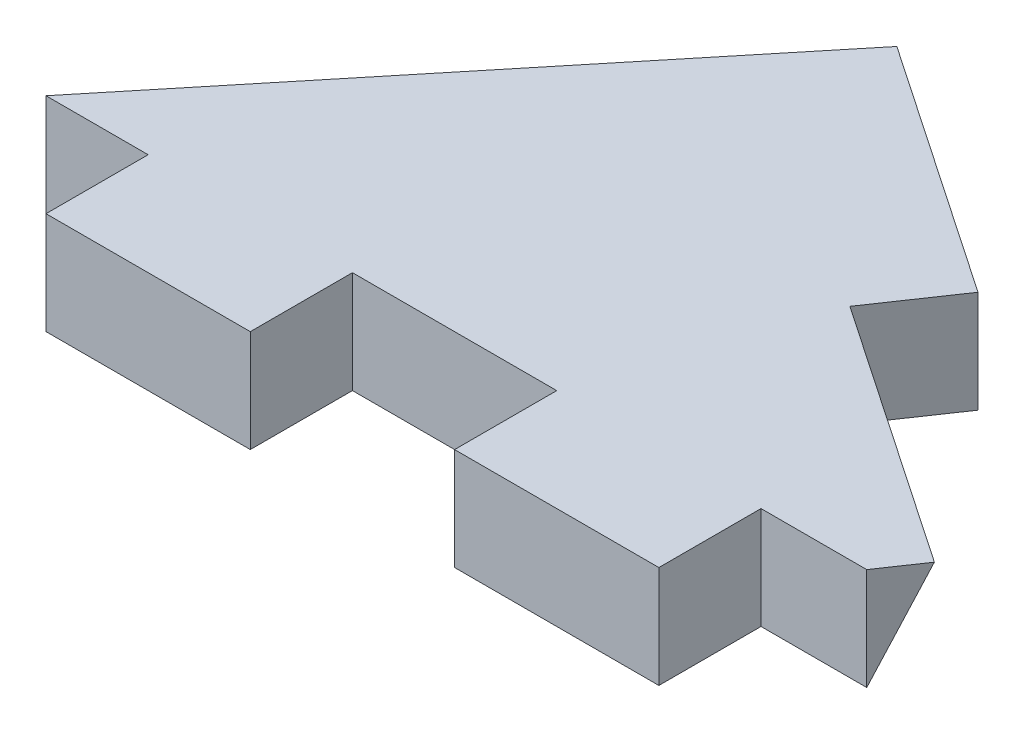
ISO-10303-21;
HEADER;
FILE_DESCRIPTION(('STEP AP214'),'2;1');
FILE_NAME('part.step','',(''),(''),'','','');
FILE_SCHEMA(('AUTOMOTIVE_DESIGN { 1 0 10303 214 1 1 1 1 }'));
ENDSEC;
DATA;
#1=APPLICATION_CONTEXT('core data for automotive mechanical design processes');
#2=APPLICATION_PROTOCOL_DEFINITION('international standard','automotive_design',2000,#1);
#3=PRODUCT_CONTEXT('',#1,'mechanical');
#4=PRODUCT('Part','Part','',(#3));
#5=PRODUCT_RELATED_PRODUCT_CATEGORY('part','',(#4));
#6=PRODUCT_DEFINITION_FORMATION('','',#4);
#7=PRODUCT_DEFINITION_CONTEXT('part definition',#1,'design');
#8=PRODUCT_DEFINITION('design','',#6,#7);
#9=PRODUCT_DEFINITION_SHAPE('','',#8);
#10=(LENGTH_UNIT() NAMED_UNIT(*) SI_UNIT(.MILLI.,.METRE.));
#11=(NAMED_UNIT(*) PLANE_ANGLE_UNIT() SI_UNIT($,.RADIAN.));
#12=(NAMED_UNIT(*) SI_UNIT($,.STERADIAN.) SOLID_ANGLE_UNIT());
#13=UNCERTAINTY_MEASURE_WITH_UNIT(LENGTH_MEASURE(1.E-05),#10,'distance_accuracy_value','');
#14=(GEOMETRIC_REPRESENTATION_CONTEXT(3) GLOBAL_UNCERTAINTY_ASSIGNED_CONTEXT((#13)) GLOBAL_UNIT_ASSIGNED_CONTEXT((#10,
#11,#12)) REPRESENTATION_CONTEXT('',''));
#15=CARTESIAN_POINT('',(0.,0.,0.));
#16=DIRECTION('',(0.,0.,1.));
#17=DIRECTION('',(1.,0.,0.));
#18=AXIS2_PLACEMENT_3D('',#15,#16,#17);
#19=CARTESIAN_POINT('',(54.526318581706,10.,-27.5542041801845));
#20=DIRECTION('',(-0.827016791360424,0.,-0.562177220107601));
#21=DIRECTION('',(-0.562177220107601,0.,0.827016791360424));
#22=AXIS2_PLACEMENT_3D('',#19,#20,#21);
#23=PLANE('',#22);
#24=DIRECTION('',(-0.241861628242692,-0.902722593813661,0.35580173046534));
#25=VECTOR('',#24,1.);
#26=CARTESIAN_POINT('',(58.3697875832957,14.345335932616,-33.2083169540525));
#27=LINE('',#26,#25);
#28=CARTESIAN_POINT('',(57.2055650069182,10.,-31.4956335063653));
#29=VERTEX_POINT('',#28);
#30=CARTESIAN_POINT('',(54.526318581706,-2.73733741694818E-11,-27.5542041801845));
#31=VERTEX_POINT('',#30);
#32=EDGE_CURVE('E270',#29,#31,#27,.T.);
#33=ORIENTED_EDGE('',*,*,#32,.T.);
#34=DIRECTION('',(0.562177220107601,0.,-0.827016791360423));
#35=VECTOR('',#34,1.);
#36=CARTESIAN_POINT('',(54.526318581706,0.,-27.5542041801845));
#37=LINE('',#36,#35);
#38=CARTESIAN_POINT('',(62.2804657900958,0.,-38.961300936598));
#39=VERTEX_POINT('',#38);
#40=EDGE_CURVE('E171',#31,#39,#37,.T.);
#41=ORIENTED_EDGE('',*,*,#40,.T.);
#42=DIRECTION('',(0.,-1.,0.));
#43=VECTOR('',#42,1.);
#44=CARTESIAN_POINT('',(62.2804657900958,10.,-38.961300936598));
#45=LINE('',#44,#43);
#46=CARTESIAN_POINT('',(62.2804657900958,10.,-38.961300936598));
#47=VERTEX_POINT('',#46);
#48=EDGE_CURVE('E41',#47,#39,#45,.T.);
#49=ORIENTED_EDGE('',*,*,#48,.F.);
#50=DIRECTION('',(0.562177220107601,0.,-0.827016791360423));
#51=VECTOR('',#50,1.);
#52=CARTESIAN_POINT('',(54.526318581706,10.,-27.5542041801845));
#53=LINE('',#52,#51);
#54=EDGE_CURVE('E48',#29,#47,#53,.T.);
#55=ORIENTED_EDGE('',*,*,#54,.F.);
#56=EDGE_LOOP('',(#33,#41,#49,#55));
#57=FACE_BOUND('',#56,.T.);
#58=ADVANCED_FACE('F33',(#57),#23,.F.);
#59=CARTESIAN_POINT('',(70.0000000000252,10.,-10.));
#60=DIRECTION('',(0.,0.,-1.));
#61=DIRECTION('',(-1.,0.,0.));
#62=AXIS2_PLACEMENT_3D('',#59,#60,#61);
#63=PLANE('',#62);
#64=DIRECTION('',(1.,0.,0.));
#65=VECTOR('',#64,1.);
#66=CARTESIAN_POINT('',(70.0000000000252,0.,-10.));
#67=LINE('',#66,#65);
#68=CARTESIAN_POINT('',(70.0000000000252,0.,-10.));
#69=VERTEX_POINT('',#68);
#70=CARTESIAN_POINT('',(80.3502422426526,0.,-10.));
#71=VERTEX_POINT('',#70);
#72=EDGE_CURVE('E164',#69,#71,#67,.T.);
#73=ORIENTED_EDGE('',*,*,#72,.T.);
#74=DIRECTION('',(0.,-1.,0.));
#75=VECTOR('',#74,1.);
#76=CARTESIAN_POINT('',(80.3502422426526,10.,-10.));
#77=LINE('',#76,#75);
#78=CARTESIAN_POINT('',(80.3502422426526,10.,-10.));
#79=VERTEX_POINT('',#78);
#80=EDGE_CURVE('E11',#79,#71,#77,.T.);
#81=ORIENTED_EDGE('',*,*,#80,.F.);
#82=DIRECTION('',(1.,0.,0.));
#83=VECTOR('',#82,1.);
#84=CARTESIAN_POINT('',(70.0000000000252,10.,-10.));
#85=LINE('',#84,#83);
#86=CARTESIAN_POINT('',(70.0000000000252,10.,-10.));
#87=VERTEX_POINT('',#86);
#88=EDGE_CURVE('E108',#87,#79,#85,.T.);
#89=ORIENTED_EDGE('',*,*,#88,.F.);
#90=DIRECTION('',(0.,-1.,0.));
#91=VECTOR('',#90,1.);
#92=CARTESIAN_POINT('',(70.0000000000252,10.,-10.));
#93=LINE('',#92,#91);
#94=EDGE_CURVE('E160',#87,#69,#93,.T.);
#95=ORIENTED_EDGE('',*,*,#94,.T.);
#96=EDGE_LOOP('',(#73,#81,#89,#95));
#97=FACE_BOUND('',#96,.T.);
#98=ADVANCED_FACE('F35',(#97),#63,.F.);
#99=CARTESIAN_POINT('',(62.2804657900958,10.,-38.961300936598));
#100=DIRECTION('',(-0.5621772201076,0.,0.827016791360424));
#101=DIRECTION('',(0.827016791360424,0.,0.5621772201076));
#102=AXIS2_PLACEMENT_3D('',#99,#100,#101);
#103=PLANE('',#102);
#104=DIRECTION('',(-0.827016791360424,0.,-0.5621772201076));
#105=VECTOR('',#104,1.);
#106=CARTESIAN_POINT('',(62.2804657900958,0.,-38.961300936598));
#107=LINE('',#106,#105);
#108=CARTESIAN_POINT('',(37.4699620492831,0.,-55.826617539826));
#109=VERTEX_POINT('',#108);
#110=EDGE_CURVE('E173',#39,#109,#107,.T.);
#111=ORIENTED_EDGE('',*,*,#110,.T.);
#112=DIRECTION('',(0.,-1.,0.));
#113=VECTOR('',#112,1.);
#114=CARTESIAN_POINT('',(37.4699620492831,10.,-55.826617539826));
#115=LINE('',#114,#113);
#116=CARTESIAN_POINT('',(37.4699620492831,10.,-55.826617539826));
#117=VERTEX_POINT('',#116);
#118=EDGE_CURVE('E209',#117,#109,#115,.T.);
#119=ORIENTED_EDGE('',*,*,#118,.F.);
#120=DIRECTION('',(-0.827016791360424,0.,-0.5621772201076));
#121=VECTOR('',#120,1.);
#122=CARTESIAN_POINT('',(62.2804657900958,10.,-38.961300936598));
#123=LINE('',#122,#121);
#124=EDGE_CURVE('E217',#47,#117,#123,.T.);
#125=ORIENTED_EDGE('',*,*,#124,.F.);
#126=ORIENTED_EDGE('',*,*,#48,.T.);
#127=EDGE_LOOP('',(#111,#119,#125,#126));
#128=FACE_BOUND('',#127,.T.);
#129=ADVANCED_FACE('F215',(#128),#103,.F.);
#130=CARTESIAN_POINT('',(0.,10.,-10.));
#131=DIRECTION('',(0.774160461544172,0.,0.632989399422861));
#132=DIRECTION('',(0.632989399422861,0.,-0.774160461544172));
#133=AXIS2_PLACEMENT_3D('',#130,#131,#132);
#134=PLANE('',#133);
#135=DIRECTION('',(-0.632989399422861,0.,0.774160461544172));
#136=VECTOR('',#135,1.);
#137=CARTESIAN_POINT('',(0.,0.,-10.));
#138=LINE('',#137,#136);
#139=CARTESIAN_POINT('',(0.,0.,-10.));
#140=VERTEX_POINT('',#139);
#141=EDGE_CURVE('E175',#109,#140,#138,.T.);
#142=ORIENTED_EDGE('',*,*,#141,.T.);
#143=DIRECTION('',(0.,-1.,0.));
#144=VECTOR('',#143,1.);
#145=CARTESIAN_POINT('',(0.,10.,-10.));
#146=LINE('',#145,#144);
#147=CARTESIAN_POINT('',(0.,10.,-10.));
#148=VERTEX_POINT('',#147);
#149=EDGE_CURVE('E206',#148,#140,#146,.T.);
#150=ORIENTED_EDGE('',*,*,#149,.F.);
#151=DIRECTION('',(-0.632989399422861,0.,0.774160461544172));
#152=VECTOR('',#151,1.);
#153=CARTESIAN_POINT('',(0.,10.,-10.));
#154=LINE('',#153,#152);
#155=EDGE_CURVE('E236',#117,#148,#154,.T.);
#156=ORIENTED_EDGE('',*,*,#155,.F.);
#157=ORIENTED_EDGE('',*,*,#118,.T.);
#158=EDGE_LOOP('',(#142,#150,#156,#157));
#159=FACE_BOUND('',#158,.T.);
#160=ADVANCED_FACE('F227',(#159),#134,.F.);
#161=CARTESIAN_POINT('',(10.0000000000253,10.,-10.));
#162=DIRECTION('',(0.,0.,-1.));
#163=DIRECTION('',(-1.,0.,0.));
#164=AXIS2_PLACEMENT_3D('',#161,#162,#163);
#165=PLANE('',#164);
#166=DIRECTION('',(1.,0.,0.));
#167=VECTOR('',#166,1.);
#168=CARTESIAN_POINT('',(10.0000000000253,0.,-10.));
#169=LINE('',#168,#167);
#170=CARTESIAN_POINT('',(10.0000000000253,0.,-10.));
#171=VERTEX_POINT('',#170);
#172=EDGE_CURVE('E177',#140,#171,#169,.T.);
#173=ORIENTED_EDGE('',*,*,#172,.T.);
#174=DIRECTION('',(0.,-1.,0.));
#175=VECTOR('',#174,1.);
#176=CARTESIAN_POINT('',(10.0000000000253,10.,-10.));
#177=LINE('',#176,#175);
#178=CARTESIAN_POINT('',(10.0000000000253,10.,-10.));
#179=VERTEX_POINT('',#178);
#180=EDGE_CURVE('E203',#179,#171,#177,.T.);
#181=ORIENTED_EDGE('',*,*,#180,.F.);
#182=DIRECTION('',(1.,0.,0.));
#183=VECTOR('',#182,1.);
#184=CARTESIAN_POINT('',(10.0000000000253,10.,-10.));
#185=LINE('',#184,#183);
#186=EDGE_CURVE('E233',#148,#179,#185,.T.);
#187=ORIENTED_EDGE('',*,*,#186,.F.);
#188=ORIENTED_EDGE('',*,*,#149,.T.);
#189=EDGE_LOOP('',(#173,#181,#187,#188));
#190=FACE_BOUND('',#189,.T.);
#191=ADVANCED_FACE('F231',(#190),#165,.F.);
#192=CARTESIAN_POINT('',(10.0000000000252,10.,0.));
#193=DIRECTION('',(1.,0.,0.));
#194=DIRECTION('',(0.,0.,-1.));
#195=AXIS2_PLACEMENT_3D('',#192,#193,#194);
#196=PLANE('',#195);
#197=DIRECTION('',(0.,0.,1.));
#198=VECTOR('',#197,1.);
#199=CARTESIAN_POINT('',(10.0000000000252,0.,0.));
#200=LINE('',#199,#198);
#201=CARTESIAN_POINT('',(10.0000000000252,0.,0.));
#202=VERTEX_POINT('',#201);
#203=EDGE_CURVE('E179',#171,#202,#200,.T.);
#204=ORIENTED_EDGE('',*,*,#203,.T.);
#205=DIRECTION('',(0.,-1.,0.));
#206=VECTOR('',#205,1.);
#207=CARTESIAN_POINT('',(10.0000000000252,10.,0.));
#208=LINE('',#207,#206);
#209=CARTESIAN_POINT('',(10.0000000000252,10.,0.));
#210=VERTEX_POINT('',#209);
#211=EDGE_CURVE('E200',#210,#202,#208,.T.);
#212=ORIENTED_EDGE('',*,*,#211,.F.);
#213=DIRECTION('',(0.,0.,1.));
#214=VECTOR('',#213,1.);
#215=CARTESIAN_POINT('',(10.0000000000252,10.,0.));
#216=LINE('',#215,#214);
#217=EDGE_CURVE('E235',#179,#210,#216,.T.);
#218=ORIENTED_EDGE('',*,*,#217,.F.);
#219=ORIENTED_EDGE('',*,*,#180,.T.);
#220=EDGE_LOOP('',(#204,#212,#218,#219));
#221=FACE_BOUND('',#220,.T.);
#222=ADVANCED_FACE('F287',(#221),#196,.F.);
#223=CARTESIAN_POINT('',(10.0000000000252,10.,0.));
#224=DIRECTION('',(0.,0.,-1.));
#225=DIRECTION('',(-1.,0.,0.));
#226=AXIS2_PLACEMENT_3D('',#223,#224,#225);
#227=PLANE('',#226);
#228=DIRECTION('',(1.,0.,0.));
#229=VECTOR('',#228,1.);
#230=CARTESIAN_POINT('',(10.0000000000252,0.,0.));
#231=LINE('',#230,#229);
#232=CARTESIAN_POINT('',(30.0000000000251,0.,0.));
#233=VERTEX_POINT('',#232);
#234=EDGE_CURVE('E181',#202,#233,#231,.T.);
#235=ORIENTED_EDGE('',*,*,#234,.T.);
#236=DIRECTION('',(0.,-1.,0.));
#237=VECTOR('',#236,1.);
#238=CARTESIAN_POINT('',(30.0000000000251,10.,0.));
#239=LINE('',#238,#237);
#240=CARTESIAN_POINT('',(30.0000000000251,10.,0.));
#241=VERTEX_POINT('',#240);
#242=EDGE_CURVE('E197',#241,#233,#239,.T.);
#243=ORIENTED_EDGE('',*,*,#242,.F.);
#244=DIRECTION('',(1.,0.,0.));
#245=VECTOR('',#244,1.);
#246=CARTESIAN_POINT('',(10.0000000000252,10.,0.));
#247=LINE('',#246,#245);
#248=EDGE_CURVE('E238',#210,#241,#247,.T.);
#249=ORIENTED_EDGE('',*,*,#248,.F.);
#250=ORIENTED_EDGE('',*,*,#211,.T.);
#251=EDGE_LOOP('',(#235,#243,#249,#250));
#252=FACE_BOUND('',#251,.T.);
#253=ADVANCED_FACE('F290',(#252),#227,.F.);
#254=CARTESIAN_POINT('',(30.0000000000251,10.,0.));
#255=DIRECTION('',(-1.,0.,0.));
#256=DIRECTION('',(0.,0.,1.));
#257=AXIS2_PLACEMENT_3D('',#254,#255,#256);
#258=PLANE('',#257);
#259=DIRECTION('',(0.,0.,-1.));
#260=VECTOR('',#259,1.);
#261=CARTESIAN_POINT('',(30.0000000000251,0.,0.));
#262=LINE('',#261,#260);
#263=CARTESIAN_POINT('',(30.0000000000251,0.,-10.));
#264=VERTEX_POINT('',#263);
#265=EDGE_CURVE('E183',#233,#264,#262,.T.);
#266=ORIENTED_EDGE('',*,*,#265,.T.);
#267=DIRECTION('',(0.,-1.,0.));
#268=VECTOR('',#267,1.);
#269=CARTESIAN_POINT('',(30.0000000000251,10.,-10.));
#270=LINE('',#269,#268);
#271=CARTESIAN_POINT('',(30.0000000000251,10.,-10.));
#272=VERTEX_POINT('',#271);
#273=EDGE_CURVE('E194',#272,#264,#270,.T.);
#274=ORIENTED_EDGE('',*,*,#273,.F.);
#275=DIRECTION('',(0.,0.,-1.));
#276=VECTOR('',#275,1.);
#277=CARTESIAN_POINT('',(30.0000000000251,10.,0.));
#278=LINE('',#277,#276);
#279=EDGE_CURVE('E244',#241,#272,#278,.T.);
#280=ORIENTED_EDGE('',*,*,#279,.F.);
#281=ORIENTED_EDGE('',*,*,#242,.T.);
#282=EDGE_LOOP('',(#266,#274,#280,#281));
#283=FACE_BOUND('',#282,.T.);
#284=ADVANCED_FACE('F250',(#283),#258,.F.);
#285=CARTESIAN_POINT('',(30.0000000000251,10.,-10.));
#286=DIRECTION('',(0.,0.,-1.));
#287=DIRECTION('',(-1.,0.,0.));
#288=AXIS2_PLACEMENT_3D('',#285,#286,#287);
#289=PLANE('',#288);
#290=DIRECTION('',(1.,0.,0.));
#291=VECTOR('',#290,1.);
#292=CARTESIAN_POINT('',(30.0000000000251,0.,-10.));
#293=LINE('',#292,#291);
#294=CARTESIAN_POINT('',(50.0000000000251,0.,-10.));
#295=VERTEX_POINT('',#294);
#296=EDGE_CURVE('E185',#264,#295,#293,.T.);
#297=ORIENTED_EDGE('',*,*,#296,.T.);
#298=DIRECTION('',(0.,-1.,0.));
#299=VECTOR('',#298,1.);
#300=CARTESIAN_POINT('',(50.0000000000251,10.,-10.));
#301=LINE('',#300,#299);
#302=CARTESIAN_POINT('',(50.0000000000251,10.,-10.));
#303=VERTEX_POINT('',#302);
#304=EDGE_CURVE('E155',#303,#295,#301,.T.);
#305=ORIENTED_EDGE('',*,*,#304,.F.);
#306=DIRECTION('',(1.,0.,0.));
#307=VECTOR('',#306,1.);
#308=CARTESIAN_POINT('',(30.0000000000251,10.,-10.));
#309=LINE('',#308,#307);
#310=EDGE_CURVE('E143',#272,#303,#309,.T.);
#311=ORIENTED_EDGE('',*,*,#310,.F.);
#312=ORIENTED_EDGE('',*,*,#273,.T.);
#313=EDGE_LOOP('',(#297,#305,#311,#312));
#314=FACE_BOUND('',#313,.T.);
#315=ADVANCED_FACE('F254',(#314),#289,.F.);
#316=CARTESIAN_POINT('',(50.0000000000251,10.,-10.));
#317=DIRECTION('',(1.,0.,0.));
#318=DIRECTION('',(0.,0.,-1.));
#319=AXIS2_PLACEMENT_3D('',#316,#317,#318);
#320=PLANE('',#319);
#321=DIRECTION('',(0.,0.,1.));
#322=VECTOR('',#321,1.);
#323=CARTESIAN_POINT('',(50.0000000000251,0.,-10.));
#324=LINE('',#323,#322);
#325=CARTESIAN_POINT('',(50.0000000000251,0.,0.));
#326=VERTEX_POINT('',#325);
#327=EDGE_CURVE('E152',#295,#326,#324,.T.);
#328=ORIENTED_EDGE('',*,*,#327,.T.);
#329=DIRECTION('',(0.,-1.,0.));
#330=VECTOR('',#329,1.);
#331=CARTESIAN_POINT('',(50.0000000000251,10.,0.));
#332=LINE('',#331,#330);
#333=CARTESIAN_POINT('',(50.0000000000251,10.,0.));
#334=VERTEX_POINT('',#333);
#335=EDGE_CURVE('E149',#334,#326,#332,.T.);
#336=ORIENTED_EDGE('',*,*,#335,.F.);
#337=DIRECTION('',(0.,0.,1.));
#338=VECTOR('',#337,1.);
#339=CARTESIAN_POINT('',(50.0000000000251,10.,-10.));
#340=LINE('',#339,#338);
#341=EDGE_CURVE('E136',#303,#334,#340,.T.);
#342=ORIENTED_EDGE('',*,*,#341,.F.);
#343=ORIENTED_EDGE('',*,*,#304,.T.);
#344=EDGE_LOOP('',(#328,#336,#342,#343));
#345=FACE_BOUND('',#344,.T.);
#346=ADVANCED_FACE('F150',(#345),#320,.F.);
#347=CARTESIAN_POINT('',(50.0000000000251,10.,0.));
#348=DIRECTION('',(0.,0.,-1.));
#349=DIRECTION('',(-1.,0.,0.));
#350=AXIS2_PLACEMENT_3D('',#347,#348,#349);
#351=PLANE('',#350);
#352=DIRECTION('',(1.,0.,0.));
#353=VECTOR('',#352,1.);
#354=CARTESIAN_POINT('',(50.0000000000251,0.,0.));
#355=LINE('',#354,#353);
#356=CARTESIAN_POINT('',(70.0000000000252,0.,0.));
#357=VERTEX_POINT('',#356);
#358=EDGE_CURVE('E188',#326,#357,#355,.T.);
#359=ORIENTED_EDGE('',*,*,#358,.T.);
#360=DIRECTION('',(0.,-1.,0.));
#361=VECTOR('',#360,1.);
#362=CARTESIAN_POINT('',(70.0000000000252,10.,0.));
#363=LINE('',#362,#361);
#364=CARTESIAN_POINT('',(70.0000000000252,10.,0.));
#365=VERTEX_POINT('',#364);
#366=EDGE_CURVE('E156',#365,#357,#363,.T.);
#367=ORIENTED_EDGE('',*,*,#366,.F.);
#368=DIRECTION('',(1.,0.,0.));
#369=VECTOR('',#368,1.);
#370=CARTESIAN_POINT('',(50.0000000000251,10.,0.));
#371=LINE('',#370,#369);
#372=EDGE_CURVE('E140',#334,#365,#371,.T.);
#373=ORIENTED_EDGE('',*,*,#372,.F.);
#374=ORIENTED_EDGE('',*,*,#335,.T.);
#375=EDGE_LOOP('',(#359,#367,#373,#374));
#376=FACE_BOUND('',#375,.T.);
#377=ADVANCED_FACE('F158',(#376),#351,.F.);
#378=CARTESIAN_POINT('',(70.0000000000252,10.,-10.));
#379=DIRECTION('',(-1.,0.,0.));
#380=DIRECTION('',(0.,0.,1.));
#381=AXIS2_PLACEMENT_3D('',#378,#379,#380);
#382=PLANE('',#381);
#383=DIRECTION('',(0.,0.,-1.));
#384=VECTOR('',#383,1.);
#385=CARTESIAN_POINT('',(70.0000000000252,0.,-10.));
#386=LINE('',#385,#384);
#387=EDGE_CURVE('E102',#357,#69,#386,.T.);
#388=ORIENTED_EDGE('',*,*,#387,.T.);
#389=ORIENTED_EDGE('',*,*,#94,.F.);
#390=DIRECTION('',(0.,0.,-1.));
#391=VECTOR('',#390,1.);
#392=CARTESIAN_POINT('',(70.0000000000252,10.,-10.));
#393=LINE('',#392,#391);
#394=EDGE_CURVE('E57',#365,#87,#393,.T.);
#395=ORIENTED_EDGE('',*,*,#394,.F.);
#396=ORIENTED_EDGE('',*,*,#366,.T.);
#397=EDGE_LOOP('',(#388,#389,#395,#396));
#398=FACE_BOUND('',#397,.T.);
#399=ADVANCED_FACE('F255',(#398),#382,.F.);
#400=CARTESIAN_POINT('',(10.0000000000253,10.,-10.));
#401=DIRECTION('',(0.,1.,0.));
#402=DIRECTION('',(0.,0.,1.));
#403=AXIS2_PLACEMENT_3D('',#400,#401,#402);
#404=PLANE('',#403);
#405=ORIENTED_EDGE('',*,*,#88,.T.);
#406=DIRECTION('',(-0.562177220107601,0.,0.827016791360423));
#407=VECTOR('',#406,1.);
#408=CARTESIAN_POINT('',(101.115433020696,10.,-40.5475939525927));
#409=LINE('',#408,#407);
#410=CARTESIAN_POINT('',(83.0294886678648,10.,-13.9414293261807));
#411=VERTEX_POINT('',#410);
#412=EDGE_CURVE('E261',#411,#79,#409,.T.);
#413=ORIENTED_EDGE('',*,*,#412,.F.);
#414=DIRECTION('',(-0.827016791360423,0.,-0.562177220107602));
#415=VECTOR('',#414,1.);
#416=CARTESIAN_POINT('',(57.2055650069181,10.,-31.4956335063652));
#417=LINE('',#416,#415);
#418=EDGE_CURVE('E265',#411,#29,#417,.T.);
#419=ORIENTED_EDGE('',*,*,#418,.T.);
#420=ORIENTED_EDGE('',*,*,#54,.T.);
#421=ORIENTED_EDGE('',*,*,#124,.T.);
#422=ORIENTED_EDGE('',*,*,#155,.T.);
#423=ORIENTED_EDGE('',*,*,#186,.T.);
#424=ORIENTED_EDGE('',*,*,#217,.T.);
#425=ORIENTED_EDGE('',*,*,#248,.T.);
#426=ORIENTED_EDGE('',*,*,#279,.T.);
#427=ORIENTED_EDGE('',*,*,#310,.T.);
#428=ORIENTED_EDGE('',*,*,#341,.T.);
#429=ORIENTED_EDGE('',*,*,#372,.T.);
#430=ORIENTED_EDGE('',*,*,#394,.T.);
#431=EDGE_LOOP('',(#405,#413,#419,#420,#421,#422,#423,#424,#425,#426,#427,#428,#429,#430));
#432=FACE_BOUND('',#431,.T.);
#433=ADVANCED_FACE('F138',(#432),#404,.T.);
#434=CARTESIAN_POINT('',(10.0000000000253,0.,-10.));
#435=DIRECTION('',(0.,1.,0.));
#436=DIRECTION('',(0.,0.,1.));
#437=AXIS2_PLACEMENT_3D('',#434,#435,#436);
#438=PLANE('',#437);
#439=ORIENTED_EDGE('',*,*,#72,.F.);
#440=ORIENTED_EDGE('',*,*,#387,.F.);
#441=ORIENTED_EDGE('',*,*,#358,.F.);
#442=ORIENTED_EDGE('',*,*,#327,.F.);
#443=ORIENTED_EDGE('',*,*,#296,.F.);
#444=ORIENTED_EDGE('',*,*,#265,.F.);
#445=ORIENTED_EDGE('',*,*,#234,.F.);
#446=ORIENTED_EDGE('',*,*,#203,.F.);
#447=ORIENTED_EDGE('',*,*,#172,.F.);
#448=ORIENTED_EDGE('',*,*,#141,.F.);
#449=ORIENTED_EDGE('',*,*,#110,.F.);
#450=ORIENTED_EDGE('',*,*,#40,.F.);
#451=DIRECTION('',(-0.827016791360423,0.,-0.562177220107601));
#452=VECTOR('',#451,1.);
#453=CARTESIAN_POINT('',(54.526318581706,0.,-27.5542041801845));
#454=LINE('',#453,#452);
#455=EDGE_CURVE('E167',#71,#31,#454,.T.);
#456=ORIENTED_EDGE('',*,*,#455,.F.);
#457=EDGE_LOOP('',(#439,#440,#441,#442,#443,#444,#445,#446,#447,#448,#449,#450,#456));
#458=FACE_BOUND('',#457,.T.);
#459=ADVANCED_FACE('F222',(#458),#438,.F.);
#460=CARTESIAN_POINT('',(101.115433020696,10.,-40.5475939525927));
#461=DIRECTION('',(-0.827016791360423,0.,-0.562177220107601));
#462=DIRECTION('',(-0.562177220107601,0.,0.827016791360423));
#463=AXIS2_PLACEMENT_3D('',#460,#461,#462);
#464=PLANE('',#463);
#465=ORIENTED_EDGE('',*,*,#80,.T.);
#466=DIRECTION('',(0.241861628242692,0.902722593813661,-0.35580173046534));
#467=VECTOR('',#466,1.);
#468=CARTESIAN_POINT('',(86.3770508081547,22.4944167464327,-18.8660153839586));
#469=LINE('',#468,#467);
#470=EDGE_CURVE('E168',#71,#411,#469,.T.);
#471=ORIENTED_EDGE('',*,*,#470,.T.);
#472=ORIENTED_EDGE('',*,*,#412,.T.);
#473=EDGE_LOOP('',(#465,#471,#472));
#474=FACE_BOUND('',#473,.T.);
#475=ADVANCED_FACE('F274',(#474),#464,.F.);
#476=CARTESIAN_POINT('',(90.1241988978577,-1253.09116772506,718.761309040568));
#477=DIRECTION('',(-0.507490078318487,0.430223103306106,0.746566743024332));
#478=DIRECTION('',(0.83924415636563,0.0504642525101183,0.54140798407923));
#479=AXIS2_PLACEMENT_3D('',#476,#477,#478);
#480=PLANE('',#479);
#481=ORIENTED_EDGE('',*,*,#455,.T.);
#482=ORIENTED_EDGE('',*,*,#32,.F.);
#483=ORIENTED_EDGE('',*,*,#418,.F.);
#484=ORIENTED_EDGE('',*,*,#470,.F.);
#485=EDGE_LOOP('',(#481,#482,#483,#484));
#486=FACE_BOUND('',#485,.T.);
#487=ADVANCED_FACE('F275',(#486),#480,.F.);
#488=CLOSED_SHELL('',(#58,#98,#129,#160,#191,#222,#253,#284,#315,#346,#377,#399,#433,#459,#475,#487));
#489=MANIFOLD_SOLID_BREP('B2',#488);
#490=ADVANCED_BREP_SHAPE_REPRESENTATION('',(#18,#489),#14);
#491=SHAPE_DEFINITION_REPRESENTATION(#9,#490);
ENDSEC;
END-ISO-10303-21;
